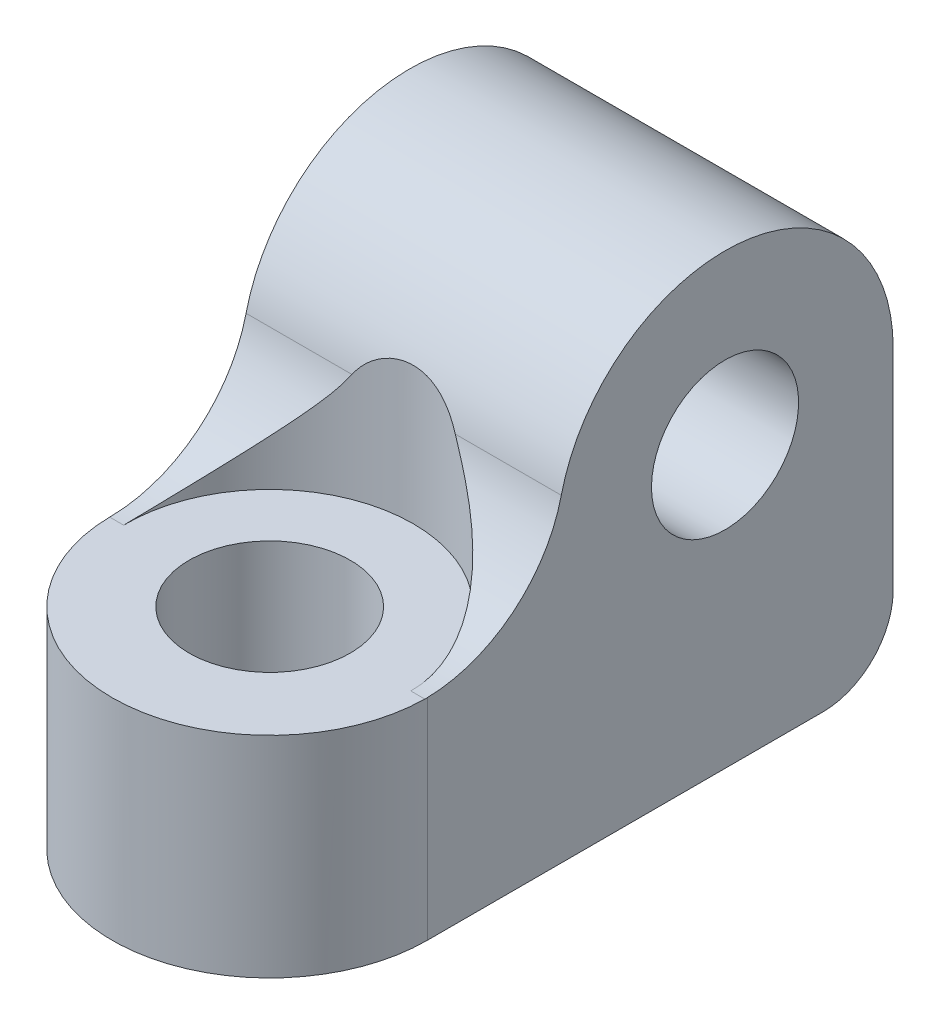
ISO-10303-21;
HEADER;
FILE_DESCRIPTION(('STEP AP214'),'2;1');
FILE_NAME('part.step','',(''),(''),'','','');
FILE_SCHEMA(('AUTOMOTIVE_DESIGN { 1 0 10303 214 1 1 1 1 }'));
ENDSEC;
DATA;
#1=APPLICATION_CONTEXT('core data for automotive mechanical design processes');
#2=APPLICATION_PROTOCOL_DEFINITION('international standard','automotive_design',2000,#1);
#3=PRODUCT_CONTEXT('',#1,'mechanical');
#4=PRODUCT('Part','Part','',(#3));
#5=PRODUCT_RELATED_PRODUCT_CATEGORY('part','',(#4));
#6=PRODUCT_DEFINITION_FORMATION('','',#4);
#7=PRODUCT_DEFINITION_CONTEXT('part definition',#1,'design');
#8=PRODUCT_DEFINITION('design','',#6,#7);
#9=PRODUCT_DEFINITION_SHAPE('','',#8);
#10=(LENGTH_UNIT() NAMED_UNIT(*) SI_UNIT(.MILLI.,.METRE.));
#11=(NAMED_UNIT(*) PLANE_ANGLE_UNIT() SI_UNIT($,.RADIAN.));
#12=(NAMED_UNIT(*) SI_UNIT($,.STERADIAN.) SOLID_ANGLE_UNIT());
#13=UNCERTAINTY_MEASURE_WITH_UNIT(LENGTH_MEASURE(1.E-05),#10,'distance_accuracy_value','');
#14=(GEOMETRIC_REPRESENTATION_CONTEXT(3) GLOBAL_UNCERTAINTY_ASSIGNED_CONTEXT((#13)) GLOBAL_UNIT_ASSIGNED_CONTEXT((#10,
#11,#12)) REPRESENTATION_CONTEXT('',''));
#15=CARTESIAN_POINT('',(0.,0.,0.));
#16=DIRECTION('',(0.,0.,1.));
#17=DIRECTION('',(1.,0.,0.));
#18=AXIS2_PLACEMENT_3D('',#15,#16,#17);
#19=CARTESIAN_POINT('',(0.,3.,0.));
#20=DIRECTION('',(0.,-1.,0.));
#21=DIRECTION('',(0.,0.,-1.));
#22=AXIS2_PLACEMENT_3D('',#19,#20,#21);
#23=CYLINDRICAL_SURFACE('',#22,1.15);
#24=CARTESIAN_POINT('',(0.,0.,0.));
#25=DIRECTION('',(0.,1.,0.));
#26=DIRECTION('',(0.,0.,1.));
#27=AXIS2_PLACEMENT_3D('',#24,#25,#26);
#28=CIRCLE('',#27,1.15);
#29=CARTESIAN_POINT('',(0.,0.,1.15));
#30=VERTEX_POINT('',#29);
#31=EDGE_CURVE('E193',#30,#30,#28,.T.);
#32=ORIENTED_EDGE('',*,*,#31,.F.);
#33=EDGE_LOOP('',(#32));
#34=FACE_BOUND('',#33,.T.);
#35=CARTESIAN_POINT('',(0.,3.,0.));
#36=DIRECTION('',(0.,1.,0.));
#37=DIRECTION('',(0.,0.,1.));
#38=AXIS2_PLACEMENT_3D('',#35,#36,#37);
#39=CIRCLE('',#38,1.15);
#40=CARTESIAN_POINT('',(0.,3.,1.15));
#41=VERTEX_POINT('',#40);
#42=EDGE_CURVE('E194',#41,#41,#39,.T.);
#43=ORIENTED_EDGE('',*,*,#42,.T.);
#44=EDGE_LOOP('',(#43));
#45=FACE_BOUND('',#44,.T.);
#46=ADVANCED_FACE('F34',(#34,#45),#23,.F.);
#47=CARTESIAN_POINT('',(10.25,4.,-4.25));
#48=DIRECTION('',(-1.,0.,0.));
#49=DIRECTION('',(0.,0.,1.));
#50=AXIS2_PLACEMENT_3D('',#47,#48,#49);
#51=CYLINDRICAL_SURFACE('',#50,2.4);
#52=CARTESIAN_POINT('',(0.737343954902168,4.54545454545454,-1.91280524156779));
#53=CARTESIAN_POINT('',(0.712265685911746,4.58699348792902,-1.9224722855136));
#54=CARTESIAN_POINT('',(0.683846857449026,4.62639068223993,-1.93286219959982));
#55=CARTESIAN_POINT('',(0.620854712675111,4.69989212091218,-1.95400721079456));
#56=CARTESIAN_POINT('',(0.586272733031313,4.73398878651634,-1.96476280447716));
#57=CARTESIAN_POINT('',(0.51146485394884,4.79583066440692,-1.98555011654691));
#58=CARTESIAN_POINT('',(0.471225505918359,4.82356031502183,-1.99558002118237));
#59=CARTESIAN_POINT('',(0.386249185984809,4.87169608925217,-2.01375124008286));
#60=CARTESIAN_POINT('',(0.341517518001375,4.89211072227712,-2.0218947448321));
#61=CARTESIAN_POINT('',(0.250661763229454,4.92443456576667,-2.03511487736964));
#62=CARTESIAN_POINT('',(0.204660417011033,4.93664500207497,-2.04029892582888));
#63=CARTESIAN_POINT('',(0.111034899255895,4.95352346930428,-2.04752891624835));
#64=CARTESIAN_POINT('',(0.0634102540859442,4.95818927934301,-2.0495739341754));
#65=CARTESIAN_POINT('',(-0.0305739989950054,4.95984225475186,-2.0502948088846));
#66=CARTESIAN_POINT('',(-0.0769290963243419,4.95705370503486,-2.0490690771704));
#67=CARTESIAN_POINT('',(-0.168450224016388,4.94433298189618,-2.0435815296345));
#68=CARTESIAN_POINT('',(-0.213616600445178,4.93440291193693,-2.0393206078008));
#69=CARTESIAN_POINT('',(-0.301397832279196,4.90765190367535,-2.02820445526693));
#70=CARTESIAN_POINT('',(-0.344018572861599,4.8908476251122,-2.02135549974175));
#71=CARTESIAN_POINT('',(-0.425714318210979,4.85074357223055,-2.00574162825482));
#72=CARTESIAN_POINT('',(-0.464788096310587,4.82744156202104,-1.99697605300241));
#73=CARTESIAN_POINT('',(-0.539283810193838,4.77435707660971,-1.97817682665332));
#74=CARTESIAN_POINT('',(-0.574604185698199,4.74444097673619,-1.9681191440362));
#75=CARTESIAN_POINT('',(-0.639831117878098,4.67930423814018,-1.94789246217522));
#76=CARTESIAN_POINT('',(-0.669743545076228,4.64408942840336,-1.93772359650128));
#77=CARTESIAN_POINT('',(-0.711118195748134,4.58687972499715,-1.92276933684414));
#78=CARTESIAN_POINT('',(-0.724652903669949,4.56643283039056,-1.9176963214459));
#79=CARTESIAN_POINT('',(-0.737343954910615,4.54545454546067,-1.91280524156773));
#80=B_SPLINE_CURVE_WITH_KNOTS('',3,(#52,#53,#54,#55,#56,#57,#58,#59,#60,#61,#62,#63,#64,#65,#66,
#67,#68,#69,#70,#71,#72,#73,#74,#75,#76,#77,#78,#79),.UNSPECIFIED.,.F.,.F.,(4,2,2,2,2,2,2,2,2,2,
2,2,2,4),(0.,0.148330130198388,0.296870431618936,0.445770006147669,0.594495802191541,
0.737409133581921,0.88036452615994,1.01906748318899,1.15772960339021,1.29605764636911,
1.43443334734953,1.57591259119598,1.71723731980635,1.79226466851074),.UNSPECIFIED.);
#81=CARTESIAN_POINT('',(0.737343954902168,4.54545454545454,-1.91280524156779));
#82=VERTEX_POINT('',#81);
#83=CARTESIAN_POINT('',(-0.737343954902167,4.54545454545455,-1.91280524156779));
#84=VERTEX_POINT('',#83);
#85=EDGE_CURVE('E116',#82,#84,#80,.T.);
#86=ORIENTED_EDGE('',*,*,#85,.F.);
#87=DIRECTION('',(-1.,0.,0.));
#88=VECTOR('',#87,1.);
#89=CARTESIAN_POINT('',(10.25,4.54545454545454,-1.91280524156779));
#90=LINE('',#89,#88);
#91=CARTESIAN_POINT('',(2.25,4.54545454545454,-1.91280524156779));
#92=VERTEX_POINT('',#91);
#93=EDGE_CURVE('E124',#82,#92,#90,.F.);
#94=ORIENTED_EDGE('',*,*,#93,.T.);
#95=CARTESIAN_POINT('',(2.25,4.,-4.25));
#96=DIRECTION('',(-1.,0.,0.));
#97=DIRECTION('',(0.,0.,1.));
#98=AXIS2_PLACEMENT_3D('',#95,#96,#97);
#99=CIRCLE('',#98,2.4);
#100=CARTESIAN_POINT('',(2.25,4.,-6.65));
#101=VERTEX_POINT('',#100);
#102=EDGE_CURVE('E185',#92,#101,#99,.T.);
#103=ORIENTED_EDGE('',*,*,#102,.T.);
#104=DIRECTION('',(-1.,0.,0.));
#105=VECTOR('',#104,1.);
#106=CARTESIAN_POINT('',(10.25,4.,-6.65));
#107=LINE('',#106,#105);
#108=CARTESIAN_POINT('',(-2.25,4.,-6.65));
#109=VERTEX_POINT('',#108);
#110=EDGE_CURVE('E186',#101,#109,#107,.T.);
#111=ORIENTED_EDGE('',*,*,#110,.T.);
#112=CARTESIAN_POINT('',(-2.25,4.,-4.25));
#113=DIRECTION('',(1.,0.,0.));
#114=DIRECTION('',(0.,0.,-1.));
#115=AXIS2_PLACEMENT_3D('',#112,#113,#114);
#116=CIRCLE('',#115,2.4);
#117=CARTESIAN_POINT('',(-2.25,4.54545454545454,-1.91280524156779));
#118=VERTEX_POINT('',#117);
#119=EDGE_CURVE('E180',#118,#109,#116,.F.);
#120=ORIENTED_EDGE('',*,*,#119,.F.);
#121=EDGE_CURVE('E132',#118,#84,#90,.F.);
#122=ORIENTED_EDGE('',*,*,#121,.T.);
#123=EDGE_LOOP('',(#86,#94,#103,#111,#120,#122));
#124=FACE_BOUND('',#123,.T.);
#125=ADVANCED_FACE('F170',(#124),#51,.T.);
#126=CARTESIAN_POINT('',(10.25,5.,0.0348570571257097));
#127=DIRECTION('',(-1.,0.,0.));
#128=DIRECTION('',(0.,0.,1.));
#129=AXIS2_PLACEMENT_3D('',#126,#127,#128);
#130=CYLINDRICAL_SURFACE('',#129,2.);
#131=CARTESIAN_POINT('',(2.04970363359402,3.,0.0348570571257093));
#132=CARTESIAN_POINT('',(2.0504808325378,2.99998890785323,-0.0101899964546947));
#133=CARTESIAN_POINT('',(2.04975097896851,3.00152155990998,-0.0552549394098561));
#134=CARTESIAN_POINT('',(2.04535536269867,3.00759959030525,-0.145005064867035));
#135=CARTESIAN_POINT('',(2.04169174848305,3.01214276352488,-0.189690501100877));
#136=CARTESIAN_POINT('',(2.03154899261911,3.02411853843841,-0.277973858501471));
#137=CARTESIAN_POINT('',(2.02509291336248,3.03152742093606,-0.321577658782601));
#138=CARTESIAN_POINT('',(2.00951996363047,3.04909073390035,-0.407736357021417));
#139=CARTESIAN_POINT('',(2.00040274952446,3.05924551893116,-0.45029111874734));
#140=CARTESIAN_POINT('',(1.96937283205074,3.09351823362681,-0.575720911516185));
#141=CARTESIAN_POINT('',(1.94374387787084,3.1214888589325,-0.656675800683504));
#142=CARTESIAN_POINT('',(1.88424105682512,3.18610591039218,-0.811837553048499));
#143=CARTESIAN_POINT('',(1.85035145562678,3.22276888947801,-0.886031162835729));
#144=CARTESIAN_POINT('',(1.76125305317038,3.31916206349085,-1.05492447978174));
#145=CARTESIAN_POINT('',(1.70292476801373,3.38226835704321,-1.14605142170986));
#146=CARTESIAN_POINT('',(1.57744457063046,3.51885471089966,-1.31345609788075));
#147=CARTESIAN_POINT('',(1.51026661545938,3.59236543898579,-1.38968828805839));
#148=CARTESIAN_POINT('',(1.39361664884135,3.72170457387385,-1.50487779184423));
#149=CARTESIAN_POINT('',(1.34560942307587,3.77537201293896,-1.54783800884381));
#150=CARTESIAN_POINT('',(1.24805461707864,3.88593211563275,-1.62752131649132));
#151=CARTESIAN_POINT('',(1.19850604660969,3.94282687281896,-1.66424029529116));
#152=CARTESIAN_POINT('',(1.09908273946363,4.05952665573943,-1.73150495406033));
#153=CARTESIAN_POINT('',(1.04920935062772,4.11932284119596,-1.76206808425555));
#154=CARTESIAN_POINT('',(0.950380897802251,4.24225086784242,-1.81726689264955));
#155=CARTESIAN_POINT('',(0.901424958030189,4.30537928261409,-1.84190852030129));
#156=CARTESIAN_POINT('',(0.833800092744309,4.39890772888556,-1.87290766174898));
#157=CARTESIAN_POINT('',(0.81374043096755,4.42750315208096,-1.88169369680672));
#158=CARTESIAN_POINT('',(0.774665114976393,4.48568506794463,-1.89811685601112));
#159=CARTESIAN_POINT('',(0.75564874912187,4.5152708623238,-1.90575476964642));
#160=CARTESIAN_POINT('',(0.737343954902167,4.54545454545455,-1.91280524156779));
#161=B_SPLINE_CURVE_WITH_KNOTS('',3,(#131,#132,#133,#134,#135,#136,#137,#138,#139,#140,#141,
#142,#143,#144,#145,#146,#147,#148,#149,#150,#151,#152,#153,#154,#155,#156,#157,#158,#159,#160),
.UNSPECIFIED.,.F.,.F.,(4,2,2,2,2,2,2,2,2,2,2,2,2,2,4),(0.,0.135097657584246,0.270096469296955,
0.40400102758301,0.537922884534296,0.804820323710535,1.07223015940605,1.44594155417606,
1.82077836221837,2.07203075294757,2.32344803733948,2.57414226523268,2.82458355249505,
2.93259716496031,3.04053616031849),.UNSPECIFIED.);
#162=CARTESIAN_POINT('',(2.04970363359402,3.,0.0348570571257097));
#163=VERTEX_POINT('',#162);
#164=EDGE_CURVE('E11',#163,#82,#161,.T.);
#165=ORIENTED_EDGE('',*,*,#164,.F.);
#166=DIRECTION('',(-1.,0.,0.));
#167=VECTOR('',#166,1.);
#168=CARTESIAN_POINT('',(0.,3.,0.0348570571257097));
#169=LINE('',#168,#167);
#170=CARTESIAN_POINT('',(2.24972998059068,3.,0.0348570571257097));
#171=VERTEX_POINT('',#170);
#172=EDGE_CURVE('E122',#171,#163,#169,.T.);
#173=ORIENTED_EDGE('',*,*,#172,.F.);
#174=CARTESIAN_POINT('',(2.25,3.00030377667793,0.));
#175=CARTESIAN_POINT('',(2.25000000274281,3.00020251570846,0.00580941690876197));
#176=CARTESIAN_POINT('',(2.24997750249677,3.00012657050056,0.0116188801236187));
#177=CARTESIAN_POINT('',(2.249887496027,3.00002531160791,0.0232378991655219));
#178=CARTESIAN_POINT('',(2.24981998980326,2.99999999792317,0.0290474549925683));
#179=CARTESIAN_POINT('',(2.24972998059068,3.,0.0348570571257097));
#180=B_SPLINE_CURVE_WITH_KNOTS('',3,(#174,#175,#176,#177,#178,#179),.UNSPECIFIED.,.F.,.F.,(4,2,
4),(0.,0.0174300094958101,0.0348600189916203),.UNSPECIFIED.);
#181=CARTESIAN_POINT('',(2.25,3.00030377667793,0.));
#182=VERTEX_POINT('',#181);
#183=EDGE_CURVE('E158',#182,#171,#180,.T.);
#184=ORIENTED_EDGE('',*,*,#183,.F.);
#185=CARTESIAN_POINT('',(2.25,5.,0.0348570571257097));
#186=DIRECTION('',(-1.,0.,0.));
#187=DIRECTION('',(0.,0.,1.));
#188=AXIS2_PLACEMENT_3D('',#185,#186,#187);
#189=CIRCLE('',#188,2.);
#190=EDGE_CURVE('E162',#92,#182,#189,.T.);
#191=ORIENTED_EDGE('',*,*,#190,.F.);
#192=ORIENTED_EDGE('',*,*,#93,.F.);
#193=EDGE_LOOP('',(#165,#173,#184,#191,#192));
#194=FACE_BOUND('',#193,.T.);
#195=ADVANCED_FACE('F36',(#194),#130,.F.);
#196=CARTESIAN_POINT('',(-0.737343954902167,4.54545454545455,-1.91280524156779));
#197=CARTESIAN_POINT('',(-0.758924153473198,4.50991920050716,-1.90449894123276));
#198=CARTESIAN_POINT('',(-0.781459002102791,4.4751932142071,-1.8953816616129));
#199=CARTESIAN_POINT('',(-0.827841138189994,4.407126905473,-1.87558016263794));
#200=CARTESIAN_POINT('',(-0.851687382942096,4.37378551811952,-1.86489717725295));
#201=CARTESIAN_POINT('',(-0.900117911832046,4.30821830762154,-1.84201234472993));
#202=CARTESIAN_POINT('',(-0.924701787091796,4.27599188701407,-1.82981132767068));
#203=CARTESIAN_POINT('',(-0.974298665914983,4.21248507664381,-1.80389164483054));
#204=CARTESIAN_POINT('',(-0.999311766665192,4.18120490568479,-1.79017263140396));
#205=CARTESIAN_POINT('',(-1.07544947411735,4.0875951209186,-1.74624612801037));
#206=CARTESIAN_POINT('',(-1.12684430592148,4.02658559772719,-1.71365090186192));
#207=CARTESIAN_POINT('',(-1.22889018179506,3.90780313203458,-1.6420181856775));
#208=CARTESIAN_POINT('',(-1.27954115124827,3.85003051261027,-1.60298005410098));
#209=CARTESIAN_POINT('',(-1.37509192651969,3.74236326474469,-1.52159193362683));
#210=CARTESIAN_POINT('',(-1.42012909779518,3.69220731776707,-1.47975082980689));
#211=CARTESIAN_POINT('',(-1.50789446603354,3.59517248922264,-1.3902104971672));
#212=CARTESIAN_POINT('',(-1.5506225110216,3.54829382329012,-1.34251088344495));
#213=CARTESIAN_POINT('',(-1.63265562469537,3.45869337596721,-1.24142806830663));
#214=CARTESIAN_POINT('',(-1.67198148783818,3.41594612190959,-1.18808459786595));
#215=CARTESIAN_POINT('',(-1.74656043751504,3.33505883850185,-1.07544607556746));
#216=CARTESIAN_POINT('',(-1.78181682317247,3.29691507594315,-1.01615591861609));
#217=CARTESIAN_POINT('',(-1.85308995208441,3.21980566716939,-0.880580751676689));
#218=CARTESIAN_POINT('',(-1.88811865457157,3.18190911180752,-0.803151425319762));
#219=CARTESIAN_POINT('',(-1.94911137875206,3.1156438144493,-0.641032018048531));
#220=CARTESIAN_POINT('',(-1.97509378669121,3.08725575132396,-0.556357105336459));
#221=CARTESIAN_POINT('',(-2.00508463045538,3.05403562315949,-0.428781673837441));
#222=CARTESIAN_POINT('',(-2.01338636704303,3.04475681296409,-0.387982913584987));
#223=CARTESIAN_POINT('',(-2.02754458355985,3.02872106594464,-0.305470079477997));
#224=CARTESIAN_POINT('',(-2.03340148879521,3.02196369051007,-0.263756166154792));
#225=CARTESIAN_POINT('',(-2.04257948499713,3.01105084748624,-0.179390731635534));
#226=CARTESIAN_POINT('',(-2.04588121009828,3.00691529265596,-0.136734522673077));
#227=CARTESIAN_POINT('',(-2.04981413214631,3.00138436360664,-0.0510943297436078));
#228=CARTESIAN_POINT('',(-2.05044352653798,2.99999083929696,-0.00811014412084751));
#229=CARTESIAN_POINT('',(-2.04970363359402,3.,0.0348570571257093));
#230=B_SPLINE_CURVE_WITH_KNOTS('',3,(#196,#197,#198,#199,#200,#201,#202,#203,#204,#205,#206,
#207,#208,#209,#210,#211,#212,#213,#214,#215,#216,#217,#218,#219,#220,#221,#222,#223,#224,#225,
#226,#227,#228,#229),.UNSPECIFIED.,.F.,.F.,(4,2,2,2,2,2,2,2,2,2,2,2,2,2,2,2,4),(0.,
0.127115270623088,0.254130892089762,0.381077362575771,0.50805296626304,0.766252729844058,
1.02447821872381,1.26220567657314,1.49994876141402,1.73611741414158,1.97209323995128,
2.25019906698332,2.52773630898314,2.65557835571904,2.78339815360068,2.91217746749725,
3.04104363253808),.UNSPECIFIED.);
#231=CARTESIAN_POINT('',(-2.04970363359402,3.,0.0348570571257097));
#232=VERTEX_POINT('',#231);
#233=EDGE_CURVE('E47',#84,#232,#230,.T.);
#234=ORIENTED_EDGE('',*,*,#233,.F.);
#235=ORIENTED_EDGE('',*,*,#121,.F.);
#236=CARTESIAN_POINT('',(-2.25,5.,0.0348570571257097));
#237=DIRECTION('',(1.,0.,0.));
#238=DIRECTION('',(0.,0.,-1.));
#239=AXIS2_PLACEMENT_3D('',#236,#237,#238);
#240=CIRCLE('',#239,2.);
#241=CARTESIAN_POINT('',(-2.25,3.00030377667793,0.));
#242=VERTEX_POINT('',#241);
#243=EDGE_CURVE('E145',#242,#118,#240,.T.);
#244=ORIENTED_EDGE('',*,*,#243,.F.);
#245=CARTESIAN_POINT('',(-2.24972998059068,3.,0.0348570571257097));
#246=CARTESIAN_POINT('',(-2.24981998980326,2.99999999792317,0.0290474549925683));
#247=CARTESIAN_POINT('',(-2.249887496027,3.00002531160791,0.0232378991655218));
#248=CARTESIAN_POINT('',(-2.24997750249677,3.00012657050056,0.0116188801236186));
#249=CARTESIAN_POINT('',(-2.25000000274281,3.00020251570846,0.00580941690876185));
#250=CARTESIAN_POINT('',(-2.25,3.00030377667793,0.));
#251=B_SPLINE_CURVE_WITH_KNOTS('',3,(#245,#246,#247,#248,#249,#250),.UNSPECIFIED.,.F.,.F.,(4,2,
4),(0.,0.0174300094958102,0.0348600189916204),.UNSPECIFIED.);
#252=CARTESIAN_POINT('',(-2.24972998059068,3.,0.0348570571257097));
#253=VERTEX_POINT('',#252);
#254=EDGE_CURVE('E139',#253,#242,#251,.T.);
#255=ORIENTED_EDGE('',*,*,#254,.F.);
#256=DIRECTION('',(-1.,0.,0.));
#257=VECTOR('',#256,1.);
#258=CARTESIAN_POINT('',(0.,3.,0.0348570571257097));
#259=LINE('',#258,#257);
#260=EDGE_CURVE('E130',#232,#253,#259,.T.);
#261=ORIENTED_EDGE('',*,*,#260,.F.);
#262=EDGE_LOOP('',(#234,#235,#244,#255,#261));
#263=FACE_BOUND('',#262,.T.);
#264=ADVANCED_FACE('F243',(#263),#130,.F.);
#265=CARTESIAN_POINT('',(0.,3.,0.));
#266=DIRECTION('',(0.,1.,0.));
#267=DIRECTION('',(0.,0.,1.));
#268=AXIS2_PLACEMENT_3D('',#265,#266,#267);
#269=PLANE('',#268);
#270=CARTESIAN_POINT('',(0.,3.,0.));
#271=DIRECTION('',(0.,1.,0.));
#272=DIRECTION('',(0.,0.,1.));
#273=AXIS2_PLACEMENT_3D('',#270,#271,#272);
#274=CIRCLE('',#273,2.05);
#275=EDGE_CURVE('E108',#163,#232,#274,.T.);
#276=ORIENTED_EDGE('',*,*,#275,.T.);
#277=ORIENTED_EDGE('',*,*,#260,.T.);
#278=CARTESIAN_POINT('',(0.,3.,0.));
#279=DIRECTION('',(0.,1.,0.));
#280=DIRECTION('',(0.,0.,1.));
#281=AXIS2_PLACEMENT_3D('',#278,#279,#280);
#282=CIRCLE('',#281,2.25);
#283=EDGE_CURVE('E129',#253,#171,#282,.T.);
#284=ORIENTED_EDGE('',*,*,#283,.T.);
#285=ORIENTED_EDGE('',*,*,#172,.T.);
#286=EDGE_LOOP('',(#276,#277,#284,#285));
#287=FACE_BOUND('',#286,.T.);
#288=ORIENTED_EDGE('',*,*,#42,.F.);
#289=EDGE_LOOP('',(#288));
#290=FACE_BOUND('',#289,.T.);
#291=ADVANCED_FACE('F126',(#287,#290),#269,.T.);
#292=CARTESIAN_POINT('',(0.,0.,0.));
#293=DIRECTION('',(0.,1.,0.));
#294=DIRECTION('',(0.,0.,1.));
#295=AXIS2_PLACEMENT_3D('',#292,#293,#294);
#296=PLANE('',#295);
#297=DIRECTION('',(0.,0.,1.));
#298=VECTOR('',#297,1.);
#299=CARTESIAN_POINT('',(-2.25,0.,-6.65));
#300=LINE('',#299,#298);
#301=CARTESIAN_POINT('',(-2.25,0.,-5.65));
#302=VERTEX_POINT('',#301);
#303=CARTESIAN_POINT('',(-2.25,0.,0.));
#304=VERTEX_POINT('',#303);
#305=EDGE_CURVE('E197',#302,#304,#300,.T.);
#306=ORIENTED_EDGE('',*,*,#305,.F.);
#307=DIRECTION('',(-1.,0.,0.));
#308=VECTOR('',#307,1.);
#309=CARTESIAN_POINT('',(0.,0.,-5.65));
#310=LINE('',#309,#308);
#311=CARTESIAN_POINT('',(2.25,0.,-5.65));
#312=VERTEX_POINT('',#311);
#313=EDGE_CURVE('E220',#302,#312,#310,.F.);
#314=ORIENTED_EDGE('',*,*,#313,.T.);
#315=DIRECTION('',(0.,0.,-1.));
#316=VECTOR('',#315,1.);
#317=CARTESIAN_POINT('',(2.25,0.,-6.65));
#318=LINE('',#317,#316);
#319=CARTESIAN_POINT('',(2.25,0.,0.));
#320=VERTEX_POINT('',#319);
#321=EDGE_CURVE('E202',#320,#312,#318,.T.);
#322=ORIENTED_EDGE('',*,*,#321,.F.);
#323=CARTESIAN_POINT('',(0.,0.,0.));
#324=DIRECTION('',(0.,1.,0.));
#325=DIRECTION('',(0.,0.,1.));
#326=AXIS2_PLACEMENT_3D('',#323,#324,#325);
#327=CIRCLE('',#326,2.25);
#328=EDGE_CURVE('E204',#304,#320,#327,.T.);
#329=ORIENTED_EDGE('',*,*,#328,.F.);
#330=EDGE_LOOP('',(#306,#314,#322,#329));
#331=FACE_BOUND('',#330,.T.);
#332=ORIENTED_EDGE('',*,*,#31,.T.);
#333=EDGE_LOOP('',(#332));
#334=FACE_BOUND('',#333,.T.);
#335=ADVANCED_FACE('F238',(#331,#334),#296,.F.);
#336=CARTESIAN_POINT('',(-2.25,3.,-6.65));
#337=DIRECTION('',(0.,0.,1.));
#338=DIRECTION('',(1.,0.,0.));
#339=AXIS2_PLACEMENT_3D('',#336,#337,#338);
#340=PLANE('',#339);
#341=DIRECTION('',(0.,-1.,0.));
#342=VECTOR('',#341,1.);
#343=CARTESIAN_POINT('',(2.25,3.,-6.65));
#344=LINE('',#343,#342);
#345=CARTESIAN_POINT('',(2.25,1.,-6.65));
#346=VERTEX_POINT('',#345);
#347=EDGE_CURVE('E201',#101,#346,#344,.T.);
#348=ORIENTED_EDGE('',*,*,#347,.T.);
#349=DIRECTION('',(-1.,0.,0.));
#350=VECTOR('',#349,1.);
#351=CARTESIAN_POINT('',(-2.25,1.,-6.65));
#352=LINE('',#351,#350);
#353=CARTESIAN_POINT('',(-2.25,1.,-6.65));
#354=VERTEX_POINT('',#353);
#355=EDGE_CURVE('E215',#346,#354,#352,.T.);
#356=ORIENTED_EDGE('',*,*,#355,.T.);
#357=DIRECTION('',(0.,-1.,0.));
#358=VECTOR('',#357,1.);
#359=CARTESIAN_POINT('',(-2.25,3.,-6.65));
#360=LINE('',#359,#358);
#361=EDGE_CURVE('E212',#109,#354,#360,.T.);
#362=ORIENTED_EDGE('',*,*,#361,.F.);
#363=ORIENTED_EDGE('',*,*,#110,.F.);
#364=EDGE_LOOP('',(#348,#356,#362,#363));
#365=FACE_BOUND('',#364,.T.);
#366=ADVANCED_FACE('F232',(#365),#340,.F.);
#367=CARTESIAN_POINT('',(-2.25,3.,-6.65));
#368=DIRECTION('',(1.,0.,0.));
#369=DIRECTION('',(0.,0.,-1.));
#370=AXIS2_PLACEMENT_3D('',#367,#368,#369);
#371=PLANE('',#370);
#372=ORIENTED_EDGE('',*,*,#361,.T.);
#373=CARTESIAN_POINT('',(-2.25,1.,-5.65));
#374=DIRECTION('',(1.,0.,0.));
#375=DIRECTION('',(0.,0.,-1.));
#376=AXIS2_PLACEMENT_3D('',#373,#374,#375);
#377=CIRCLE('',#376,1.);
#378=EDGE_CURVE('E218',#354,#302,#377,.F.);
#379=ORIENTED_EDGE('',*,*,#378,.T.);
#380=ORIENTED_EDGE('',*,*,#305,.T.);
#381=DIRECTION('',(0.,-1.,0.));
#382=VECTOR('',#381,1.);
#383=CARTESIAN_POINT('',(-2.25,3.,0.));
#384=LINE('',#383,#382);
#385=EDGE_CURVE('E62',#242,#304,#384,.T.);
#386=ORIENTED_EDGE('',*,*,#385,.F.);
#387=ORIENTED_EDGE('',*,*,#243,.T.);
#388=ORIENTED_EDGE('',*,*,#119,.T.);
#389=EDGE_LOOP('',(#372,#379,#380,#386,#387,#388));
#390=FACE_BOUND('',#389,.T.);
#391=CARTESIAN_POINT('',(-2.25,4.,-4.25));
#392=DIRECTION('',(1.,0.,0.));
#393=DIRECTION('',(0.,0.,-1.));
#394=AXIS2_PLACEMENT_3D('',#391,#392,#393);
#395=CIRCLE('',#394,1.05);
#396=CARTESIAN_POINT('',(-2.25,4.,-5.3));
#397=VERTEX_POINT('',#396);
#398=EDGE_CURVE('E182',#397,#397,#395,.F.);
#399=ORIENTED_EDGE('',*,*,#398,.F.);
#400=EDGE_LOOP('',(#399));
#401=FACE_BOUND('',#400,.T.);
#402=ADVANCED_FACE('F153',(#390,#401),#371,.F.);
#403=CARTESIAN_POINT('',(0.,3.,0.));
#404=DIRECTION('',(0.,-1.,0.));
#405=DIRECTION('',(0.,0.,-1.));
#406=AXIS2_PLACEMENT_3D('',#403,#404,#405);
#407=CYLINDRICAL_SURFACE('',#406,2.25);
#408=ORIENTED_EDGE('',*,*,#328,.T.);
#409=DIRECTION('',(0.,-1.,0.));
#410=VECTOR('',#409,1.);
#411=CARTESIAN_POINT('',(2.25,3.,0.));
#412=LINE('',#411,#410);
#413=EDGE_CURVE('E54',#182,#320,#412,.T.);
#414=ORIENTED_EDGE('',*,*,#413,.F.);
#415=ORIENTED_EDGE('',*,*,#183,.T.);
#416=ORIENTED_EDGE('',*,*,#283,.F.);
#417=ORIENTED_EDGE('',*,*,#254,.T.);
#418=ORIENTED_EDGE('',*,*,#385,.T.);
#419=EDGE_LOOP('',(#408,#414,#415,#416,#417,#418));
#420=FACE_BOUND('',#419,.T.);
#421=ADVANCED_FACE('F147',(#420),#407,.T.);
#422=CARTESIAN_POINT('',(2.25,3.,-6.65));
#423=DIRECTION('',(-1.,0.,0.));
#424=DIRECTION('',(0.,0.,1.));
#425=AXIS2_PLACEMENT_3D('',#422,#423,#424);
#426=PLANE('',#425);
#427=ORIENTED_EDGE('',*,*,#321,.T.);
#428=CARTESIAN_POINT('',(2.25,1.,-5.65));
#429=DIRECTION('',(-1.,0.,0.));
#430=DIRECTION('',(0.,0.,1.));
#431=AXIS2_PLACEMENT_3D('',#428,#429,#430);
#432=CIRCLE('',#431,1.);
#433=EDGE_CURVE('E134',#312,#346,#432,.F.);
#434=ORIENTED_EDGE('',*,*,#433,.T.);
#435=ORIENTED_EDGE('',*,*,#347,.F.);
#436=ORIENTED_EDGE('',*,*,#102,.F.);
#437=ORIENTED_EDGE('',*,*,#190,.T.);
#438=ORIENTED_EDGE('',*,*,#413,.T.);
#439=EDGE_LOOP('',(#427,#434,#435,#436,#437,#438));
#440=FACE_BOUND('',#439,.T.);
#441=CARTESIAN_POINT('',(2.25,4.,-4.25));
#442=DIRECTION('',(-1.,0.,0.));
#443=DIRECTION('',(0.,0.,1.));
#444=AXIS2_PLACEMENT_3D('',#441,#442,#443);
#445=CIRCLE('',#444,1.05);
#446=CARTESIAN_POINT('',(2.25,4.,-3.2));
#447=VERTEX_POINT('',#446);
#448=EDGE_CURVE('E189',#447,#447,#445,.T.);
#449=ORIENTED_EDGE('',*,*,#448,.T.);
#450=EDGE_LOOP('',(#449));
#451=FACE_BOUND('',#450,.T.);
#452=ADVANCED_FACE('F152',(#440,#451),#426,.F.);
#453=CARTESIAN_POINT('',(10.25,4.,-4.25));
#454=DIRECTION('',(-1.,0.,0.));
#455=DIRECTION('',(0.,0.,1.));
#456=AXIS2_PLACEMENT_3D('',#453,#454,#455);
#457=CYLINDRICAL_SURFACE('',#456,1.05);
#458=ORIENTED_EDGE('',*,*,#398,.T.);
#459=EDGE_LOOP('',(#458));
#460=FACE_BOUND('',#459,.T.);
#461=ORIENTED_EDGE('',*,*,#448,.F.);
#462=EDGE_LOOP('',(#461));
#463=FACE_BOUND('',#462,.T.);
#464=ADVANCED_FACE('F259',(#460,#463),#457,.F.);
#465=CARTESIAN_POINT('',(-2.25,1.,-5.65));
#466=DIRECTION('',(-1.,0.,0.));
#467=DIRECTION('',(0.,0.,1.));
#468=AXIS2_PLACEMENT_3D('',#465,#466,#467);
#469=CYLINDRICAL_SURFACE('',#468,1.);
#470=ORIENTED_EDGE('',*,*,#433,.F.);
#471=ORIENTED_EDGE('',*,*,#313,.F.);
#472=ORIENTED_EDGE('',*,*,#378,.F.);
#473=ORIENTED_EDGE('',*,*,#355,.F.);
#474=EDGE_LOOP('',(#470,#471,#472,#473));
#475=FACE_BOUND('',#474,.T.);
#476=ADVANCED_FACE('F169',(#475),#469,.T.);
#477=CARTESIAN_POINT('',(0.,13.,0.));
#478=DIRECTION('',(0.,-1.,0.));
#479=DIRECTION('',(0.,0.,-1.));
#480=AXIS2_PLACEMENT_3D('',#477,#478,#479);
#481=CYLINDRICAL_SURFACE('',#480,2.05);
#482=ORIENTED_EDGE('',*,*,#164,.T.);
#483=ORIENTED_EDGE('',*,*,#85,.T.);
#484=ORIENTED_EDGE('',*,*,#233,.T.);
#485=ORIENTED_EDGE('',*,*,#275,.F.);
#486=EDGE_LOOP('',(#482,#483,#484,#485));
#487=FACE_BOUND('',#486,.T.);
#488=ADVANCED_FACE('F110',(#487),#481,.F.);
#489=CLOSED_SHELL('',(#46,#125,#195,#264,#291,#335,#366,#402,#421,#452,#464,#476,#488));
#490=MANIFOLD_SOLID_BREP('B2',#489);
#491=ADVANCED_BREP_SHAPE_REPRESENTATION('',(#18,#490),#14);
#492=SHAPE_DEFINITION_REPRESENTATION(#9,#491);
ENDSEC;
END-ISO-10303-21;
